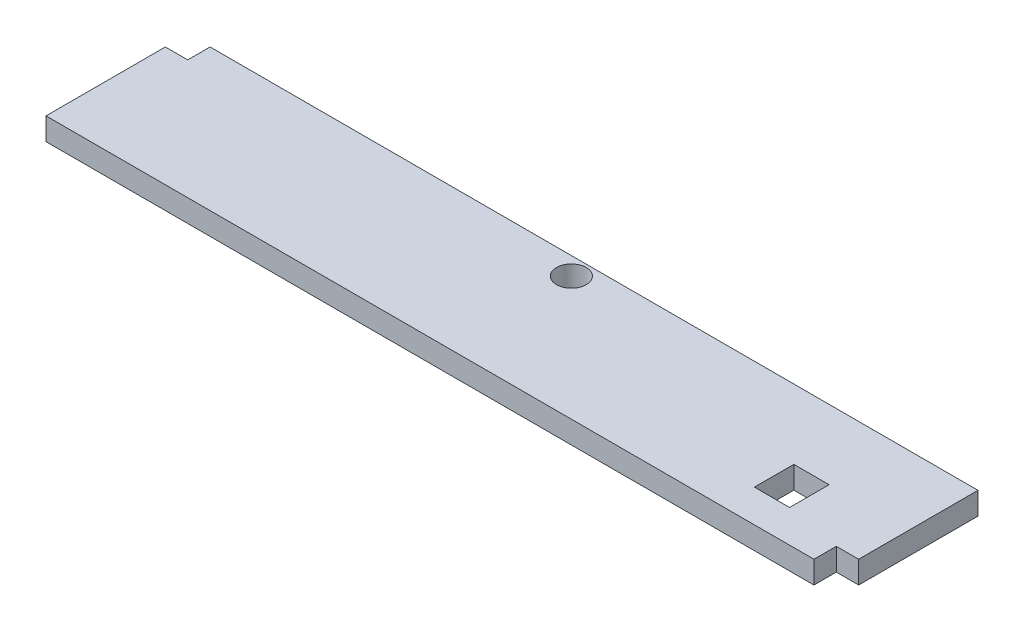
ISO-10303-21;
HEADER;
FILE_DESCRIPTION(('STEP AP214'),'2;1');
FILE_NAME('part.step','',(''),(''),'','','');
FILE_SCHEMA(('AUTOMOTIVE_DESIGN { 1 0 10303 214 1 1 1 1 }'));
ENDSEC;
DATA;
#1=APPLICATION_CONTEXT('core data for automotive mechanical design processes');
#2=APPLICATION_PROTOCOL_DEFINITION('international standard','automotive_design',2000,#1);
#3=PRODUCT_CONTEXT('',#1,'mechanical');
#4=PRODUCT('Part','Part','',(#3));
#5=PRODUCT_RELATED_PRODUCT_CATEGORY('part','',(#4));
#6=PRODUCT_DEFINITION_FORMATION('','',#4);
#7=PRODUCT_DEFINITION_CONTEXT('part definition',#1,'design');
#8=PRODUCT_DEFINITION('design','',#6,#7);
#9=PRODUCT_DEFINITION_SHAPE('','',#8);
#10=(LENGTH_UNIT() NAMED_UNIT(*) SI_UNIT(.MILLI.,.METRE.));
#11=(NAMED_UNIT(*) PLANE_ANGLE_UNIT() SI_UNIT($,.RADIAN.));
#12=(NAMED_UNIT(*) SI_UNIT($,.STERADIAN.) SOLID_ANGLE_UNIT());
#13=UNCERTAINTY_MEASURE_WITH_UNIT(LENGTH_MEASURE(1.E-05),#10,'distance_accuracy_value','');
#14=(GEOMETRIC_REPRESENTATION_CONTEXT(3) GLOBAL_UNCERTAINTY_ASSIGNED_CONTEXT((#13)) GLOBAL_UNIT_ASSIGNED_CONTEXT((#10,
#11,#12)) REPRESENTATION_CONTEXT('',''));
#15=CARTESIAN_POINT('',(0.,0.,0.));
#16=DIRECTION('',(0.,0.,1.));
#17=DIRECTION('',(1.,0.,0.));
#18=AXIS2_PLACEMENT_3D('',#15,#16,#17);
#19=CARTESIAN_POINT('',(0.,19.05,0.));
#20=DIRECTION('',(1.,0.,0.));
#21=DIRECTION('',(0.,0.,-1.));
#22=AXIS2_PLACEMENT_3D('',#19,#20,#21);
#23=PLANE('',#22);
#24=DIRECTION('',(0.,0.,1.));
#25=VECTOR('',#24,1.);
#26=CARTESIAN_POINT('',(0.,19.05,0.));
#27=LINE('',#26,#25);
#28=CARTESIAN_POINT('',(0.,19.05,-101.6508));
#29=VERTEX_POINT('',#28);
#30=CARTESIAN_POINT('',(0.,19.05,0.));
#31=VERTEX_POINT('',#30);
#32=EDGE_CURVE('E209',#29,#31,#27,.T.);
#33=ORIENTED_EDGE('',*,*,#32,.F.);
#34=DIRECTION('',(0.,-1.,0.));
#35=VECTOR('',#34,1.);
#36=CARTESIAN_POINT('',(0.,19.05,-101.6508));
#37=LINE('',#36,#35);
#38=CARTESIAN_POINT('',(0.,0.,-101.6508));
#39=VERTEX_POINT('',#38);
#40=EDGE_CURVE('E160',#29,#39,#37,.T.);
#41=ORIENTED_EDGE('',*,*,#40,.T.);
#42=DIRECTION('',(0.,0.,1.));
#43=VECTOR('',#42,1.);
#44=CARTESIAN_POINT('',(0.,0.,0.));
#45=LINE('',#44,#43);
#46=CARTESIAN_POINT('',(0.,0.,0.));
#47=VERTEX_POINT('',#46);
#48=EDGE_CURVE('E202',#39,#47,#45,.T.);
#49=ORIENTED_EDGE('',*,*,#48,.T.);
#50=DIRECTION('',(0.,-1.,0.));
#51=VECTOR('',#50,1.);
#52=CARTESIAN_POINT('',(0.,19.05,0.));
#53=LINE('',#52,#51);
#54=EDGE_CURVE('E11',#31,#47,#53,.T.);
#55=ORIENTED_EDGE('',*,*,#54,.F.);
#56=EDGE_LOOP('',(#33,#41,#49,#55));
#57=FACE_BOUND('',#56,.T.);
#58=ADVANCED_FACE('F39',(#57),#23,.F.);
#59=CARTESIAN_POINT('',(0.,19.05,0.));
#60=DIRECTION('',(0.,0.,-1.));
#61=DIRECTION('',(-1.,0.,0.));
#62=AXIS2_PLACEMENT_3D('',#59,#60,#61);
#63=PLANE('',#62);
#64=DIRECTION('',(1.,0.,0.));
#65=VECTOR('',#64,1.);
#66=CARTESIAN_POINT('',(0.,0.,0.));
#67=LINE('',#66,#65);
#68=CARTESIAN_POINT('',(654.05,0.,0.));
#69=VERTEX_POINT('',#68);
#70=EDGE_CURVE('E219',#47,#69,#67,.T.);
#71=ORIENTED_EDGE('',*,*,#70,.T.);
#72=DIRECTION('',(0.,-1.,0.));
#73=VECTOR('',#72,1.);
#74=CARTESIAN_POINT('',(654.05,19.05,0.));
#75=LINE('',#74,#73);
#76=CARTESIAN_POINT('',(654.05,19.05,0.));
#77=VERTEX_POINT('',#76);
#78=EDGE_CURVE('E152',#77,#69,#75,.T.);
#79=ORIENTED_EDGE('',*,*,#78,.F.);
#80=DIRECTION('',(1.,0.,0.));
#81=VECTOR('',#80,1.);
#82=CARTESIAN_POINT('',(0.,19.05,0.));
#83=LINE('',#82,#81);
#84=EDGE_CURVE('E145',#31,#77,#83,.T.);
#85=ORIENTED_EDGE('',*,*,#84,.F.);
#86=ORIENTED_EDGE('',*,*,#54,.T.);
#87=EDGE_LOOP('',(#71,#79,#85,#86));
#88=FACE_BOUND('',#87,.T.);
#89=ADVANCED_FACE('F245',(#88),#63,.F.);
#90=CARTESIAN_POINT('',(673.1,19.05,0.));
#91=DIRECTION('',(-1.,0.,0.));
#92=DIRECTION('',(0.,0.,1.));
#93=AXIS2_PLACEMENT_3D('',#90,#91,#92);
#94=PLANE('',#93);
#95=DIRECTION('',(0.,0.,-1.));
#96=VECTOR('',#95,1.);
#97=CARTESIAN_POINT('',(673.1,19.05,0.));
#98=LINE('',#97,#96);
#99=CARTESIAN_POINT('',(673.1,19.05,-19.05));
#100=VERTEX_POINT('',#99);
#101=CARTESIAN_POINT('',(673.1,19.05,-120.7008));
#102=VERTEX_POINT('',#101);
#103=EDGE_CURVE('E213',#100,#102,#98,.T.);
#104=ORIENTED_EDGE('',*,*,#103,.F.);
#105=DIRECTION('',(0.,-1.,0.));
#106=VECTOR('',#105,1.);
#107=CARTESIAN_POINT('',(673.1,19.05,-19.05));
#108=LINE('',#107,#106);
#109=CARTESIAN_POINT('',(673.1,0.,-19.05));
#110=VERTEX_POINT('',#109);
#111=EDGE_CURVE('E133',#100,#110,#108,.T.);
#112=ORIENTED_EDGE('',*,*,#111,.T.);
#113=DIRECTION('',(0.,0.,-1.));
#114=VECTOR('',#113,1.);
#115=CARTESIAN_POINT('',(673.1,0.,0.));
#116=LINE('',#115,#114);
#117=CARTESIAN_POINT('',(673.1,0.,-120.7008));
#118=VERTEX_POINT('',#117);
#119=EDGE_CURVE('E222',#110,#118,#116,.T.);
#120=ORIENTED_EDGE('',*,*,#119,.T.);
#121=DIRECTION('',(0.,-1.,0.));
#122=VECTOR('',#121,1.);
#123=CARTESIAN_POINT('',(673.1,19.05,-120.7008));
#124=LINE('',#123,#122);
#125=EDGE_CURVE('E46',#102,#118,#124,.T.);
#126=ORIENTED_EDGE('',*,*,#125,.F.);
#127=EDGE_LOOP('',(#104,#112,#120,#126));
#128=FACE_BOUND('',#127,.T.);
#129=ADVANCED_FACE('F243',(#128),#94,.F.);
#130=CARTESIAN_POINT('',(0.,19.05,-120.7008));
#131=DIRECTION('',(0.,0.,1.));
#132=DIRECTION('',(1.,0.,0.));
#133=AXIS2_PLACEMENT_3D('',#130,#131,#132);
#134=PLANE('',#133);
#135=DIRECTION('',(-1.,0.,0.));
#136=VECTOR('',#135,1.);
#137=CARTESIAN_POINT('',(0.,0.,-120.7008));
#138=LINE('',#137,#136);
#139=CARTESIAN_POINT('',(19.05,0.,-120.7008));
#140=VERTEX_POINT('',#139);
#141=EDGE_CURVE('E211',#118,#140,#138,.T.);
#142=ORIENTED_EDGE('',*,*,#141,.T.);
#143=DIRECTION('',(0.,-1.,0.));
#144=VECTOR('',#143,1.);
#145=CARTESIAN_POINT('',(19.05,19.05,-120.7008));
#146=LINE('',#145,#144);
#147=CARTESIAN_POINT('',(19.05,19.05,-120.7008));
#148=VERTEX_POINT('',#147);
#149=EDGE_CURVE('E61',#148,#140,#146,.T.);
#150=ORIENTED_EDGE('',*,*,#149,.F.);
#151=DIRECTION('',(-1.,0.,0.));
#152=VECTOR('',#151,1.);
#153=CARTESIAN_POINT('',(0.,19.05,-120.7008));
#154=LINE('',#153,#152);
#155=EDGE_CURVE('E215',#102,#148,#154,.T.);
#156=ORIENTED_EDGE('',*,*,#155,.F.);
#157=ORIENTED_EDGE('',*,*,#125,.T.);
#158=EDGE_LOOP('',(#142,#150,#156,#157));
#159=FACE_BOUND('',#158,.T.);
#160=ADVANCED_FACE('F230',(#159),#134,.F.);
#161=CARTESIAN_POINT('',(0.,19.05,0.));
#162=DIRECTION('',(0.,-1.,0.));
#163=DIRECTION('',(0.,0.,-1.));
#164=AXIS2_PLACEMENT_3D('',#161,#162,#163);
#165=PLANE('',#164);
#166=CARTESIAN_POINT('',(341.9094,19.05,-105.5624));
#167=DIRECTION('',(0.,-1.,0.));
#168=DIRECTION('',(0.,0.,-1.));
#169=AXIS2_PLACEMENT_3D('',#166,#167,#168);
#170=CIRCLE('',#169,12.7);
#171=CARTESIAN_POINT('',(341.9094,19.05,-118.2624));
#172=VERTEX_POINT('',#171);
#173=EDGE_CURVE('E171',#172,#172,#170,.T.);
#174=ORIENTED_EDGE('',*,*,#173,.T.);
#175=EDGE_LOOP('',(#174));
#176=FACE_BOUND('',#175,.T.);
#177=DIRECTION('',(1.,0.,0.));
#178=VECTOR('',#177,1.);
#179=CARTESIAN_POINT('',(605.536642683544,19.05,-61.4240406592317));
#180=LINE('',#179,#178);
#181=CARTESIAN_POINT('',(575.523004504634,19.05,-61.4240406592317));
#182=VERTEX_POINT('',#181);
#183=CARTESIAN_POINT('',(605.536642683544,19.05,-61.4240406592317));
#184=VERTEX_POINT('',#183);
#185=EDGE_CURVE('E187',#182,#184,#180,.T.);
#186=ORIENTED_EDGE('',*,*,#185,.T.);
#187=DIRECTION('',(0.,0.,1.));
#188=VECTOR('',#187,1.);
#189=CARTESIAN_POINT('',(605.536642683544,19.05,-61.4240406592317));
#190=LINE('',#189,#188);
#191=CARTESIAN_POINT('',(605.536642683544,19.05,-27.8087658988532));
#192=VERTEX_POINT('',#191);
#193=EDGE_CURVE('E177',#184,#192,#190,.T.);
#194=ORIENTED_EDGE('',*,*,#193,.T.);
#195=DIRECTION('',(-1.,0.,0.));
#196=VECTOR('',#195,1.);
#197=CARTESIAN_POINT('',(605.536642683544,19.05,-27.8087658988532));
#198=LINE('',#197,#196);
#199=CARTESIAN_POINT('',(575.523004504634,19.05,-27.8087658988532));
#200=VERTEX_POINT('',#199);
#201=EDGE_CURVE('E180',#192,#200,#198,.T.);
#202=ORIENTED_EDGE('',*,*,#201,.T.);
#203=DIRECTION('',(0.,0.,-1.));
#204=VECTOR('',#203,1.);
#205=CARTESIAN_POINT('',(575.523004504634,19.05,-61.4240406592317));
#206=LINE('',#205,#204);
#207=EDGE_CURVE('E184',#200,#182,#206,.T.);
#208=ORIENTED_EDGE('',*,*,#207,.T.);
#209=EDGE_LOOP('',(#186,#194,#202,#208));
#210=FACE_BOUND('',#209,.T.);
#211=ORIENTED_EDGE('',*,*,#84,.T.);
#212=DIRECTION('',(0.,0.,-1.));
#213=VECTOR('',#212,1.);
#214=CARTESIAN_POINT('',(654.05,19.05,0.));
#215=LINE('',#214,#213);
#216=CARTESIAN_POINT('',(654.05,19.05,-19.05));
#217=VERTEX_POINT('',#216);
#218=EDGE_CURVE('E129',#77,#217,#215,.T.);
#219=ORIENTED_EDGE('',*,*,#218,.T.);
#220=DIRECTION('',(1.,0.,0.));
#221=VECTOR('',#220,1.);
#222=CARTESIAN_POINT('',(654.05,19.05,-19.05));
#223=LINE('',#222,#221);
#224=EDGE_CURVE('E134',#217,#100,#223,.T.);
#225=ORIENTED_EDGE('',*,*,#224,.T.);
#226=ORIENTED_EDGE('',*,*,#103,.T.);
#227=ORIENTED_EDGE('',*,*,#155,.T.);
#228=DIRECTION('',(0.,0.,1.));
#229=VECTOR('',#228,1.);
#230=CARTESIAN_POINT('',(19.05,19.05,-120.7008));
#231=LINE('',#230,#229);
#232=CARTESIAN_POINT('',(19.05,19.05,-101.6508));
#233=VERTEX_POINT('',#232);
#234=EDGE_CURVE('E165',#148,#233,#231,.T.);
#235=ORIENTED_EDGE('',*,*,#234,.T.);
#236=DIRECTION('',(-1.,0.,0.));
#237=VECTOR('',#236,1.);
#238=CARTESIAN_POINT('',(0.,19.05,-101.6508));
#239=LINE('',#238,#237);
#240=EDGE_CURVE('E157',#233,#29,#239,.T.);
#241=ORIENTED_EDGE('',*,*,#240,.T.);
#242=ORIENTED_EDGE('',*,*,#32,.T.);
#243=EDGE_LOOP('',(#211,#219,#225,#226,#227,#235,#241,#242));
#244=FACE_BOUND('',#243,.T.);
#245=ADVANCED_FACE('F143',(#176,#210,#244),#165,.F.);
#246=CARTESIAN_POINT('',(0.,0.,0.));
#247=DIRECTION('',(0.,-1.,0.));
#248=DIRECTION('',(0.,0.,-1.));
#249=AXIS2_PLACEMENT_3D('',#246,#247,#248);
#250=PLANE('',#249);
#251=DIRECTION('',(0.,0.,-1.));
#252=VECTOR('',#251,1.);
#253=CARTESIAN_POINT('',(654.05,0.,0.));
#254=LINE('',#253,#252);
#255=CARTESIAN_POINT('',(654.05,0.,-19.05));
#256=VERTEX_POINT('',#255);
#257=EDGE_CURVE('E53',#69,#256,#254,.T.);
#258=ORIENTED_EDGE('',*,*,#257,.F.);
#259=ORIENTED_EDGE('',*,*,#70,.F.);
#260=ORIENTED_EDGE('',*,*,#48,.F.);
#261=DIRECTION('',(-1.,0.,0.));
#262=VECTOR('',#261,1.);
#263=CARTESIAN_POINT('',(0.,0.,-101.6508));
#264=LINE('',#263,#262);
#265=CARTESIAN_POINT('',(19.05,0.,-101.6508));
#266=VERTEX_POINT('',#265);
#267=EDGE_CURVE('E163',#266,#39,#264,.T.);
#268=ORIENTED_EDGE('',*,*,#267,.F.);
#269=DIRECTION('',(0.,0.,1.));
#270=VECTOR('',#269,1.);
#271=CARTESIAN_POINT('',(19.05,0.,-120.7008));
#272=LINE('',#271,#270);
#273=EDGE_CURVE('E150',#140,#266,#272,.T.);
#274=ORIENTED_EDGE('',*,*,#273,.F.);
#275=ORIENTED_EDGE('',*,*,#141,.F.);
#276=ORIENTED_EDGE('',*,*,#119,.F.);
#277=DIRECTION('',(1.,0.,0.));
#278=VECTOR('',#277,1.);
#279=CARTESIAN_POINT('',(654.05,0.,-19.05));
#280=LINE('',#279,#278);
#281=EDGE_CURVE('E146',#256,#110,#280,.T.);
#282=ORIENTED_EDGE('',*,*,#281,.F.);
#283=EDGE_LOOP('',(#258,#259,#260,#268,#274,#275,#276,#282));
#284=FACE_BOUND('',#283,.T.);
#285=CARTESIAN_POINT('',(341.9094,0.,-105.5624));
#286=DIRECTION('',(0.,-1.,0.));
#287=DIRECTION('',(0.,0.,-1.));
#288=AXIS2_PLACEMENT_3D('',#285,#286,#287);
#289=CIRCLE('',#288,12.7);
#290=CARTESIAN_POINT('',(341.9094,0.,-118.2624));
#291=VERTEX_POINT('',#290);
#292=EDGE_CURVE('E154',#291,#291,#289,.T.);
#293=ORIENTED_EDGE('',*,*,#292,.F.);
#294=EDGE_LOOP('',(#293));
#295=FACE_BOUND('',#294,.T.);
#296=DIRECTION('',(0.,0.,1.));
#297=VECTOR('',#296,1.);
#298=CARTESIAN_POINT('',(605.536642683544,0.,-61.4240406592317));
#299=LINE('',#298,#297);
#300=CARTESIAN_POINT('',(605.536642683544,0.,-61.4240406592317));
#301=VERTEX_POINT('',#300);
#302=CARTESIAN_POINT('',(605.536642683544,0.,-27.8087658988532));
#303=VERTEX_POINT('',#302);
#304=EDGE_CURVE('E174',#301,#303,#299,.T.);
#305=ORIENTED_EDGE('',*,*,#304,.F.);
#306=DIRECTION('',(1.,0.,0.));
#307=VECTOR('',#306,1.);
#308=CARTESIAN_POINT('',(605.536642683544,0.,-61.4240406592317));
#309=LINE('',#308,#307);
#310=CARTESIAN_POINT('',(575.523004504634,0.,-61.4240406592317));
#311=VERTEX_POINT('',#310);
#312=EDGE_CURVE('E181',#311,#301,#309,.T.);
#313=ORIENTED_EDGE('',*,*,#312,.F.);
#314=DIRECTION('',(0.,0.,-1.));
#315=VECTOR('',#314,1.);
#316=CARTESIAN_POINT('',(575.523004504634,0.,-61.4240406592317));
#317=LINE('',#316,#315);
#318=CARTESIAN_POINT('',(575.523004504634,0.,-27.8087658988532));
#319=VERTEX_POINT('',#318);
#320=EDGE_CURVE('E195',#319,#311,#317,.T.);
#321=ORIENTED_EDGE('',*,*,#320,.F.);
#322=DIRECTION('',(-1.,0.,0.));
#323=VECTOR('',#322,1.);
#324=CARTESIAN_POINT('',(605.536642683544,0.,-27.8087658988532));
#325=LINE('',#324,#323);
#326=EDGE_CURVE('E192',#303,#319,#325,.T.);
#327=ORIENTED_EDGE('',*,*,#326,.F.);
#328=EDGE_LOOP('',(#305,#313,#321,#327));
#329=FACE_BOUND('',#328,.T.);
#330=ADVANCED_FACE('F234',(#284,#295,#329),#250,.T.);
#331=CARTESIAN_POINT('',(605.536642683544,19.05,-61.4240406592317));
#332=DIRECTION('',(1.,0.,0.));
#333=DIRECTION('',(0.,0.,-1.));
#334=AXIS2_PLACEMENT_3D('',#331,#332,#333);
#335=PLANE('',#334);
#336=ORIENTED_EDGE('',*,*,#304,.T.);
#337=DIRECTION('',(0.,-1.,0.));
#338=VECTOR('',#337,1.);
#339=CARTESIAN_POINT('',(605.536642683544,19.05,-27.8087658988532));
#340=LINE('',#339,#338);
#341=EDGE_CURVE('E190',#192,#303,#340,.T.);
#342=ORIENTED_EDGE('',*,*,#341,.F.);
#343=ORIENTED_EDGE('',*,*,#193,.F.);
#344=DIRECTION('',(0.,-1.,0.));
#345=VECTOR('',#344,1.);
#346=CARTESIAN_POINT('',(605.536642683544,19.05,-61.4240406592317));
#347=LINE('',#346,#345);
#348=EDGE_CURVE('E200',#184,#301,#347,.T.);
#349=ORIENTED_EDGE('',*,*,#348,.T.);
#350=EDGE_LOOP('',(#336,#342,#343,#349));
#351=FACE_BOUND('',#350,.T.);
#352=ADVANCED_FACE('F298',(#351),#335,.F.);
#353=CARTESIAN_POINT('',(605.536642683544,19.05,-61.4240406592317));
#354=DIRECTION('',(0.,0.,-1.));
#355=DIRECTION('',(-1.,0.,0.));
#356=AXIS2_PLACEMENT_3D('',#353,#354,#355);
#357=PLANE('',#356);
#358=ORIENTED_EDGE('',*,*,#312,.T.);
#359=ORIENTED_EDGE('',*,*,#348,.F.);
#360=ORIENTED_EDGE('',*,*,#185,.F.);
#361=DIRECTION('',(0.,-1.,0.));
#362=VECTOR('',#361,1.);
#363=CARTESIAN_POINT('',(575.523004504634,19.05,-61.4240406592317));
#364=LINE('',#363,#362);
#365=EDGE_CURVE('E203',#182,#311,#364,.T.);
#366=ORIENTED_EDGE('',*,*,#365,.T.);
#367=EDGE_LOOP('',(#358,#359,#360,#366));
#368=FACE_BOUND('',#367,.T.);
#369=ADVANCED_FACE('F308',(#368),#357,.F.);
#370=CARTESIAN_POINT('',(575.523004504634,19.05,-61.4240406592317));
#371=DIRECTION('',(-1.,0.,0.));
#372=DIRECTION('',(0.,0.,1.));
#373=AXIS2_PLACEMENT_3D('',#370,#371,#372);
#374=PLANE('',#373);
#375=ORIENTED_EDGE('',*,*,#320,.T.);
#376=ORIENTED_EDGE('',*,*,#365,.F.);
#377=ORIENTED_EDGE('',*,*,#207,.F.);
#378=DIRECTION('',(0.,-1.,0.));
#379=VECTOR('',#378,1.);
#380=CARTESIAN_POINT('',(575.523004504634,19.05,-27.8087658988532));
#381=LINE('',#380,#379);
#382=EDGE_CURVE('E205',#200,#319,#381,.T.);
#383=ORIENTED_EDGE('',*,*,#382,.T.);
#384=EDGE_LOOP('',(#375,#376,#377,#383));
#385=FACE_BOUND('',#384,.T.);
#386=ADVANCED_FACE('F318',(#385),#374,.F.);
#387=CARTESIAN_POINT('',(605.536642683544,19.05,-27.8087658988532));
#388=DIRECTION('',(0.,0.,1.));
#389=DIRECTION('',(1.,0.,0.));
#390=AXIS2_PLACEMENT_3D('',#387,#388,#389);
#391=PLANE('',#390);
#392=ORIENTED_EDGE('',*,*,#326,.T.);
#393=ORIENTED_EDGE('',*,*,#382,.F.);
#394=ORIENTED_EDGE('',*,*,#201,.F.);
#395=ORIENTED_EDGE('',*,*,#341,.T.);
#396=EDGE_LOOP('',(#392,#393,#394,#395));
#397=FACE_BOUND('',#396,.T.);
#398=ADVANCED_FACE('F328',(#397),#391,.F.);
#399=CARTESIAN_POINT('',(341.9094,19.05,-105.5624));
#400=DIRECTION('',(0.,-1.,0.));
#401=DIRECTION('',(0.,0.,-1.));
#402=AXIS2_PLACEMENT_3D('',#399,#400,#401);
#403=CYLINDRICAL_SURFACE('',#402,12.7);
#404=ORIENTED_EDGE('',*,*,#173,.F.);
#405=EDGE_LOOP('',(#404));
#406=FACE_BOUND('',#405,.T.);
#407=ORIENTED_EDGE('',*,*,#292,.T.);
#408=EDGE_LOOP('',(#407));
#409=FACE_BOUND('',#408,.T.);
#410=ADVANCED_FACE('F264',(#406,#409),#403,.F.);
#411=CARTESIAN_POINT('',(0.,19.05,-101.6508));
#412=DIRECTION('',(0.,0.,1.));
#413=DIRECTION('',(1.,0.,0.));
#414=AXIS2_PLACEMENT_3D('',#411,#412,#413);
#415=PLANE('',#414);
#416=ORIENTED_EDGE('',*,*,#267,.T.);
#417=ORIENTED_EDGE('',*,*,#40,.F.);
#418=ORIENTED_EDGE('',*,*,#240,.F.);
#419=DIRECTION('',(0.,-1.,0.));
#420=VECTOR('',#419,1.);
#421=CARTESIAN_POINT('',(19.05,19.05,-101.6508));
#422=LINE('',#421,#420);
#423=EDGE_CURVE('E158',#233,#266,#422,.T.);
#424=ORIENTED_EDGE('',*,*,#423,.T.);
#425=EDGE_LOOP('',(#416,#417,#418,#424));
#426=FACE_BOUND('',#425,.T.);
#427=ADVANCED_FACE('F241',(#426),#415,.F.);
#428=CARTESIAN_POINT('',(19.05,19.05,-120.7008));
#429=DIRECTION('',(1.,0.,0.));
#430=DIRECTION('',(0.,0.,-1.));
#431=AXIS2_PLACEMENT_3D('',#428,#429,#430);
#432=PLANE('',#431);
#433=ORIENTED_EDGE('',*,*,#273,.T.);
#434=ORIENTED_EDGE('',*,*,#423,.F.);
#435=ORIENTED_EDGE('',*,*,#234,.F.);
#436=ORIENTED_EDGE('',*,*,#149,.T.);
#437=EDGE_LOOP('',(#433,#434,#435,#436));
#438=FACE_BOUND('',#437,.T.);
#439=ADVANCED_FACE('F238',(#438),#432,.F.);
#440=CARTESIAN_POINT('',(654.05,19.05,0.));
#441=DIRECTION('',(-1.,0.,0.));
#442=DIRECTION('',(0.,0.,1.));
#443=AXIS2_PLACEMENT_3D('',#440,#441,#442);
#444=PLANE('',#443);
#445=ORIENTED_EDGE('',*,*,#257,.T.);
#446=DIRECTION('',(0.,-1.,0.));
#447=VECTOR('',#446,1.);
#448=CARTESIAN_POINT('',(654.05,19.05,-19.05));
#449=LINE('',#448,#447);
#450=EDGE_CURVE('E125',#217,#256,#449,.T.);
#451=ORIENTED_EDGE('',*,*,#450,.F.);
#452=ORIENTED_EDGE('',*,*,#218,.F.);
#453=ORIENTED_EDGE('',*,*,#78,.T.);
#454=EDGE_LOOP('',(#445,#451,#452,#453));
#455=FACE_BOUND('',#454,.T.);
#456=ADVANCED_FACE('F127',(#455),#444,.F.);
#457=CARTESIAN_POINT('',(654.05,19.05,-19.05));
#458=DIRECTION('',(0.,0.,-1.));
#459=DIRECTION('',(-1.,0.,0.));
#460=AXIS2_PLACEMENT_3D('',#457,#458,#459);
#461=PLANE('',#460);
#462=ORIENTED_EDGE('',*,*,#281,.T.);
#463=ORIENTED_EDGE('',*,*,#111,.F.);
#464=ORIENTED_EDGE('',*,*,#224,.F.);
#465=ORIENTED_EDGE('',*,*,#450,.T.);
#466=EDGE_LOOP('',(#462,#463,#464,#465));
#467=FACE_BOUND('',#466,.T.);
#468=ADVANCED_FACE('F137',(#467),#461,.F.);
#469=CLOSED_SHELL('',(#58,#89,#129,#160,#245,#330,#352,#369,#386,#398,#410,#427,#439,#456,#468));
#470=MANIFOLD_SOLID_BREP('B2',#469);
#471=ADVANCED_BREP_SHAPE_REPRESENTATION('',(#18,#470),#14);
#472=SHAPE_DEFINITION_REPRESENTATION(#9,#471);
ENDSEC;
END-ISO-10303-21;
